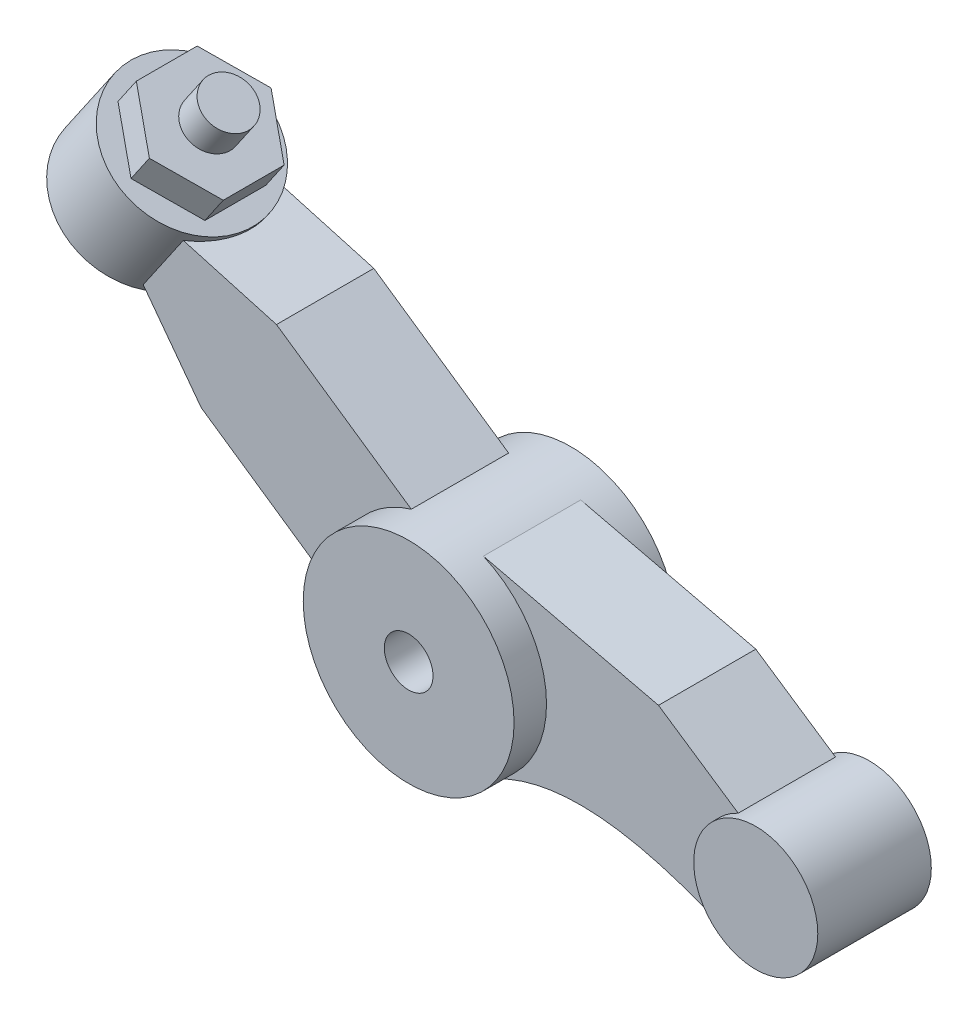
ISO-10303-21;
HEADER;
FILE_DESCRIPTION(('STEP AP214'),'2;1');
FILE_NAME('part.step','',(''),(''),'','','');
FILE_SCHEMA(('AUTOMOTIVE_DESIGN { 1 0 10303 214 1 1 1 1 }'));
ENDSEC;
DATA;
#1=APPLICATION_CONTEXT('core data for automotive mechanical design processes');
#2=APPLICATION_PROTOCOL_DEFINITION('international standard','automotive_design',2000,#1);
#3=PRODUCT_CONTEXT('',#1,'mechanical');
#4=PRODUCT('Part','Part','',(#3));
#5=PRODUCT_RELATED_PRODUCT_CATEGORY('part','',(#4));
#6=PRODUCT_DEFINITION_FORMATION('','',#4);
#7=PRODUCT_DEFINITION_CONTEXT('part definition',#1,'design');
#8=PRODUCT_DEFINITION('design','',#6,#7);
#9=PRODUCT_DEFINITION_SHAPE('','',#8);
#10=(LENGTH_UNIT() NAMED_UNIT(*) SI_UNIT(.MILLI.,.METRE.));
#11=(NAMED_UNIT(*) PLANE_ANGLE_UNIT() SI_UNIT($,.RADIAN.));
#12=(NAMED_UNIT(*) SI_UNIT($,.STERADIAN.) SOLID_ANGLE_UNIT());
#13=UNCERTAINTY_MEASURE_WITH_UNIT(LENGTH_MEASURE(1.E-05),#10,'distance_accuracy_value','');
#14=(GEOMETRIC_REPRESENTATION_CONTEXT(3) GLOBAL_UNCERTAINTY_ASSIGNED_CONTEXT((#13)) GLOBAL_UNIT_ASSIGNED_CONTEXT((#10,
#11,#12)) REPRESENTATION_CONTEXT('',''));
#15=CARTESIAN_POINT('',(0.,0.,0.));
#16=DIRECTION('',(0.,0.,1.));
#17=DIRECTION('',(1.,0.,0.));
#18=AXIS2_PLACEMENT_3D('',#15,#16,#17);
#19=CARTESIAN_POINT('',(0.,0.,1.));
#20=DIRECTION('',(0.,0.,-1.));
#21=DIRECTION('',(-1.,0.,0.));
#22=AXIS2_PLACEMENT_3D('',#19,#20,#21);
#23=CYLINDRICAL_SURFACE('',#22,0.3);
#24=CARTESIAN_POINT('',(0.,0.,1.));
#25=DIRECTION('',(0.,0.,1.));
#26=DIRECTION('',(1.,0.,0.));
#27=AXIS2_PLACEMENT_3D('',#24,#25,#26);
#28=CIRCLE('',#27,0.3);
#29=CARTESIAN_POINT('',(0.3,0.,1.));
#30=VERTEX_POINT('',#29);
#31=EDGE_CURVE('E286',#30,#30,#28,.T.);
#32=ORIENTED_EDGE('',*,*,#31,.T.);
#33=EDGE_LOOP('',(#32));
#34=FACE_BOUND('',#33,.T.);
#35=CARTESIAN_POINT('',(0.,0.,-1.));
#36=DIRECTION('',(0.,0.,1.));
#37=DIRECTION('',(1.,0.,0.));
#38=AXIS2_PLACEMENT_3D('',#35,#36,#37);
#39=CIRCLE('',#38,0.3);
#40=CARTESIAN_POINT('',(0.3,0.,-1.));
#41=VERTEX_POINT('',#40);
#42=EDGE_CURVE('E287',#41,#41,#39,.T.);
#43=ORIENTED_EDGE('',*,*,#42,.F.);
#44=EDGE_LOOP('',(#43));
#45=FACE_BOUND('',#44,.T.);
#46=ADVANCED_FACE('F35',(#34,#45),#23,.F.);
#47=CARTESIAN_POINT('',(0.,0.,1.));
#48=DIRECTION('',(0.,0.,-1.));
#49=DIRECTION('',(-1.,0.,0.));
#50=AXIS2_PLACEMENT_3D('',#47,#48,#49);
#51=CYLINDRICAL_SURFACE('',#50,1.3);
#52=DIRECTION('',(0.,0.,-1.));
#53=VECTOR('',#52,1.);
#54=CARTESIAN_POINT('',(-0.367546709514205,1.2469600700605,0.6));
#55=LINE('',#54,#53);
#56=CARTESIAN_POINT('',(-0.367546709514206,1.2469600700605,0.6));
#57=VERTEX_POINT('',#56);
#58=CARTESIAN_POINT('',(-0.367546709514206,1.2469600700605,-0.6));
#59=VERTEX_POINT('',#58);
#60=EDGE_CURVE('E229',#57,#59,#55,.T.);
#61=ORIENTED_EDGE('',*,*,#60,.F.);
#62=CARTESIAN_POINT('',(0.,0.,0.6));
#63=DIRECTION('',(0.,0.,1.));
#64=DIRECTION('',(1.,0.,0.));
#65=AXIS2_PLACEMENT_3D('',#62,#63,#64);
#66=CIRCLE('',#65,1.3);
#67=CARTESIAN_POINT('',(-1.29574513197099,-0.105093068151436,0.6));
#68=VERTEX_POINT('',#67);
#69=EDGE_CURVE('E197',#57,#68,#66,.T.);
#70=ORIENTED_EDGE('',*,*,#69,.T.);
#71=DIRECTION('',(0.,0.,-1.));
#72=VECTOR('',#71,1.);
#73=CARTESIAN_POINT('',(-1.29574513197099,-0.105093068151436,0.6));
#74=LINE('',#73,#72);
#75=CARTESIAN_POINT('',(-1.29574513197099,-0.105093068151436,-0.6));
#76=VERTEX_POINT('',#75);
#77=EDGE_CURVE('E210',#68,#76,#74,.T.);
#78=ORIENTED_EDGE('',*,*,#77,.T.);
#79=CARTESIAN_POINT('',(0.,0.,-0.6));
#80=DIRECTION('',(0.,0.,1.));
#81=DIRECTION('',(1.,0.,0.));
#82=AXIS2_PLACEMENT_3D('',#79,#80,#81);
#83=CIRCLE('',#82,1.3);
#84=EDGE_CURVE('E196',#59,#76,#83,.T.);
#85=ORIENTED_EDGE('',*,*,#84,.F.);
#86=EDGE_LOOP('',(#61,#70,#78,#85));
#87=FACE_BOUND('',#86,.T.);
#88=DIRECTION('',(0.,0.,-1.));
#89=VECTOR('',#88,1.);
#90=CARTESIAN_POINT('',(0.676601676553519,-1.11004962559562,0.6));
#91=LINE('',#90,#89);
#92=CARTESIAN_POINT('',(0.676601676553519,-1.11004962559562,0.6));
#93=VERTEX_POINT('',#92);
#94=CARTESIAN_POINT('',(0.676601676553519,-1.11004962559562,-0.6));
#95=VERTEX_POINT('',#94);
#96=EDGE_CURVE('E277',#93,#95,#91,.T.);
#97=ORIENTED_EDGE('',*,*,#96,.F.);
#98=CARTESIAN_POINT('',(0.,0.,0.6));
#99=DIRECTION('',(0.,0.,1.));
#100=DIRECTION('',(1.,0.,0.));
#101=AXIS2_PLACEMENT_3D('',#98,#99,#100);
#102=CIRCLE('',#101,1.3);
#103=CARTESIAN_POINT('',(0.521604487071266,1.19076813824822,0.6));
#104=VERTEX_POINT('',#103);
#105=EDGE_CURVE('E311',#93,#104,#102,.T.);
#106=ORIENTED_EDGE('',*,*,#105,.T.);
#107=DIRECTION('',(0.,0.,-1.));
#108=VECTOR('',#107,1.);
#109=CARTESIAN_POINT('',(0.521604487071265,1.19076813824822,0.6));
#110=LINE('',#109,#108);
#111=CARTESIAN_POINT('',(0.521604487071265,1.19076813824822,-0.6));
#112=VERTEX_POINT('',#111);
#113=EDGE_CURVE('E308',#104,#112,#110,.T.);
#114=ORIENTED_EDGE('',*,*,#113,.T.);
#115=CARTESIAN_POINT('',(0.,0.,-0.6));
#116=DIRECTION('',(0.,0.,1.));
#117=DIRECTION('',(1.,0.,0.));
#118=AXIS2_PLACEMENT_3D('',#115,#116,#117);
#119=CIRCLE('',#118,1.3);
#120=EDGE_CURVE('E246',#95,#112,#119,.T.);
#121=ORIENTED_EDGE('',*,*,#120,.F.);
#122=EDGE_LOOP('',(#97,#106,#114,#121));
#123=FACE_BOUND('',#122,.T.);
#124=CARTESIAN_POINT('',(0.,0.,1.));
#125=DIRECTION('',(0.,0.,1.));
#126=DIRECTION('',(1.,0.,0.));
#127=AXIS2_PLACEMENT_3D('',#124,#125,#126);
#128=CIRCLE('',#127,1.3);
#129=CARTESIAN_POINT('',(1.3,0.,1.));
#130=VERTEX_POINT('',#129);
#131=EDGE_CURVE('E281',#130,#130,#128,.T.);
#132=ORIENTED_EDGE('',*,*,#131,.F.);
#133=EDGE_LOOP('',(#132));
#134=FACE_BOUND('',#133,.T.);
#135=CARTESIAN_POINT('',(0.,0.,-1.));
#136=DIRECTION('',(0.,0.,1.));
#137=DIRECTION('',(1.,0.,0.));
#138=AXIS2_PLACEMENT_3D('',#135,#136,#137);
#139=CIRCLE('',#138,1.3);
#140=CARTESIAN_POINT('',(1.3,0.,-1.));
#141=VERTEX_POINT('',#140);
#142=EDGE_CURVE('E284',#141,#141,#139,.T.);
#143=ORIENTED_EDGE('',*,*,#142,.T.);
#144=EDGE_LOOP('',(#143));
#145=FACE_BOUND('',#144,.T.);
#146=ADVANCED_FACE('F263',(#87,#123,#134,#145),#51,.T.);
#147=CARTESIAN_POINT('',(0.,0.,1.));
#148=DIRECTION('',(0.,0.,1.));
#149=DIRECTION('',(1.,0.,0.));
#150=AXIS2_PLACEMENT_3D('',#147,#148,#149);
#151=PLANE('',#150);
#152=ORIENTED_EDGE('',*,*,#31,.F.);
#153=EDGE_LOOP('',(#152));
#154=FACE_BOUND('',#153,.T.);
#155=ORIENTED_EDGE('',*,*,#131,.T.);
#156=EDGE_LOOP('',(#155));
#157=FACE_BOUND('',#156,.T.);
#158=ADVANCED_FACE('F260',(#154,#157),#151,.T.);
#159=CARTESIAN_POINT('',(0.,0.,-1.));
#160=DIRECTION('',(0.,0.,1.));
#161=DIRECTION('',(1.,0.,0.));
#162=AXIS2_PLACEMENT_3D('',#159,#160,#161);
#163=PLANE('',#162);
#164=ORIENTED_EDGE('',*,*,#42,.T.);
#165=EDGE_LOOP('',(#164));
#166=FACE_BOUND('',#165,.T.);
#167=ORIENTED_EDGE('',*,*,#142,.F.);
#168=EDGE_LOOP('',(#167));
#169=FACE_BOUND('',#168,.T.);
#170=ADVANCED_FACE('F257',(#166,#169),#163,.F.);
#171=CARTESIAN_POINT('',(3.66351130448171,-1.376462422252,0.6));
#172=CARTESIAN_POINT('',(2.75633744734306,-0.967349054136237,0.6));
#173=CARTESIAN_POINT('',(1.62181799975988,-0.614489973839438,0.6));
#174=CARTESIAN_POINT('',(0.676601676553519,-1.11004962559562,0.6));
#175=B_SPLINE_CURVE_WITH_KNOTS('',3,(#171,#172,#173,#174),.UNSPECIFIED.,.F.,.F.,(4,4),(0.,1.),.UNSPECIFIED.);
#176=DIRECTION('',(0.,0.,-1.));
#177=VECTOR('',#176,1.);
#178=SURFACE_OF_LINEAR_EXTRUSION('',#175,#177);
#179=CARTESIAN_POINT('',(3.66351130448171,-1.376462422252,-0.6));
#180=CARTESIAN_POINT('',(2.75633744734306,-0.967349054136237,-0.6));
#181=CARTESIAN_POINT('',(1.62181799975988,-0.614489973839438,-0.6));
#182=CARTESIAN_POINT('',(0.676601676553519,-1.11004962559562,-0.6));
#183=B_SPLINE_CURVE_WITH_KNOTS('',3,(#179,#180,#181,#182),.UNSPECIFIED.,.F.,.F.,(4,4),(0.,1.),.UNSPECIFIED.);
#184=CARTESIAN_POINT('',(3.66351130448171,-1.376462422252,-0.6));
#185=VERTEX_POINT('',#184);
#186=EDGE_CURVE('E236',#185,#95,#183,.T.);
#187=ORIENTED_EDGE('',*,*,#186,.F.);
#188=DIRECTION('',(0.,0.,-1.));
#189=VECTOR('',#188,1.);
#190=CARTESIAN_POINT('',(3.66351130448171,-1.376462422252,0.6));
#191=LINE('',#190,#189);
#192=CARTESIAN_POINT('',(3.66351130448171,-1.376462422252,0.6));
#193=VERTEX_POINT('',#192);
#194=EDGE_CURVE('E292',#193,#185,#191,.T.);
#195=ORIENTED_EDGE('',*,*,#194,.F.);
#196=EDGE_CURVE('E239',#193,#93,#175,.T.);
#197=ORIENTED_EDGE('',*,*,#196,.T.);
#198=ORIENTED_EDGE('',*,*,#96,.T.);
#199=EDGE_LOOP('',(#187,#195,#197,#198));
#200=FACE_BOUND('',#199,.T.);
#201=ADVANCED_FACE('F252',(#200),#178,.T.);
#202=CARTESIAN_POINT('',(1.14784729029702,1.70754456504759,0.6));
#203=DIRECTION('',(-0.557887392801173,-0.829916656630959,0.));
#204=DIRECTION('',(0.829916656630959,-0.557887392801173,0.));
#205=AXIS2_PLACEMENT_3D('',#202,#203,#204);
#206=PLANE('',#205);
#207=DIRECTION('',(-0.829916656630959,0.557887392801173,0.));
#208=VECTOR('',#207,1.);
#209=CARTESIAN_POINT('',(1.14784729029702,1.70754456504759,-0.6));
#210=LINE('',#209,#208);
#211=CARTESIAN_POINT('',(3.66351130448171,0.016462422252005,-0.6));
#212=VERTEX_POINT('',#211);
#213=CARTESIAN_POINT('',(2.68078674033149,0.677070497237568,-0.6));
#214=VERTEX_POINT('',#213);
#215=EDGE_CURVE('E317',#212,#214,#210,.T.);
#216=ORIENTED_EDGE('',*,*,#215,.T.);
#217=DIRECTION('',(0.,0.,-1.));
#218=VECTOR('',#217,1.);
#219=CARTESIAN_POINT('',(2.68078674033149,0.677070497237568,0.6));
#220=LINE('',#219,#218);
#221=CARTESIAN_POINT('',(2.68078674033149,0.677070497237568,0.6));
#222=VERTEX_POINT('',#221);
#223=EDGE_CURVE('E305',#222,#214,#220,.T.);
#224=ORIENTED_EDGE('',*,*,#223,.F.);
#225=DIRECTION('',(-0.829916656630959,0.557887392801173,0.));
#226=VECTOR('',#225,1.);
#227=CARTESIAN_POINT('',(1.14784729029702,1.70754456504759,0.6));
#228=LINE('',#227,#226);
#229=CARTESIAN_POINT('',(3.66351130448171,0.0164624222520048,0.6));
#230=VERTEX_POINT('',#229);
#231=EDGE_CURVE('E332',#230,#222,#228,.T.);
#232=ORIENTED_EDGE('',*,*,#231,.F.);
#233=DIRECTION('',(0.,0.,-1.));
#234=VECTOR('',#233,1.);
#235=CARTESIAN_POINT('',(3.66351130448171,0.0164624222520045,0.6));
#236=LINE('',#235,#234);
#237=EDGE_CURVE('E302',#230,#212,#236,.T.);
#238=ORIENTED_EDGE('',*,*,#237,.T.);
#239=EDGE_LOOP('',(#216,#224,#232,#238));
#240=FACE_BOUND('',#239,.T.);
#241=ADVANCED_FACE('F256',(#240),#206,.F.);
#242=CARTESIAN_POINT('',(0.296065386840388,1.24442683406666,0.6));
#243=DIRECTION('',(-0.231452793916526,-0.972846135927071,0.));
#244=DIRECTION('',(0.972846135927072,-0.231452793916526,0.));
#245=AXIS2_PLACEMENT_3D('',#242,#243,#244);
#246=PLANE('',#245);
#247=DIRECTION('',(-0.972846135927071,0.231452793916526,0.));
#248=VECTOR('',#247,1.);
#249=CARTESIAN_POINT('',(0.296065386840388,1.24442683406666,-0.6));
#250=LINE('',#249,#248);
#251=EDGE_CURVE('E314',#214,#112,#250,.T.);
#252=ORIENTED_EDGE('',*,*,#251,.T.);
#253=ORIENTED_EDGE('',*,*,#113,.F.);
#254=DIRECTION('',(-0.972846135927071,0.231452793916526,0.));
#255=VECTOR('',#254,1.);
#256=CARTESIAN_POINT('',(0.296065386840388,1.24442683406666,0.6));
#257=LINE('',#256,#255);
#258=EDGE_CURVE('E330',#222,#104,#257,.T.);
#259=ORIENTED_EDGE('',*,*,#258,.F.);
#260=ORIENTED_EDGE('',*,*,#223,.T.);
#261=EDGE_LOOP('',(#252,#253,#259,#260));
#262=FACE_BOUND('',#261,.T.);
#263=ADVANCED_FACE('F349',(#262),#246,.F.);
#264=CARTESIAN_POINT('',(0.,0.,0.6));
#265=DIRECTION('',(0.,0.,1.));
#266=DIRECTION('',(1.,0.,0.));
#267=AXIS2_PLACEMENT_3D('',#264,#265,#266);
#268=PLANE('',#267);
#269=ORIENTED_EDGE('',*,*,#196,.F.);
#270=CARTESIAN_POINT('',(3.98,-0.68,0.6));
#271=DIRECTION('',(0.,0.,1.));
#272=DIRECTION('',(1.,0.,0.));
#273=AXIS2_PLACEMENT_3D('',#270,#271,#272);
#274=CIRCLE('',#273,0.765);
#275=EDGE_CURVE('E245',#230,#193,#274,.T.);
#276=ORIENTED_EDGE('',*,*,#275,.F.);
#277=ORIENTED_EDGE('',*,*,#231,.T.);
#278=ORIENTED_EDGE('',*,*,#258,.T.);
#279=ORIENTED_EDGE('',*,*,#105,.F.);
#280=EDGE_LOOP('',(#269,#276,#277,#278,#279));
#281=FACE_BOUND('',#280,.T.);
#282=ADVANCED_FACE('F344',(#281),#268,.T.);
#283=CARTESIAN_POINT('',(0.,0.,-0.6));
#284=DIRECTION('',(0.,0.,1.));
#285=DIRECTION('',(1.,0.,0.));
#286=AXIS2_PLACEMENT_3D('',#283,#284,#285);
#287=PLANE('',#286);
#288=ORIENTED_EDGE('',*,*,#186,.T.);
#289=ORIENTED_EDGE('',*,*,#120,.T.);
#290=ORIENTED_EDGE('',*,*,#251,.F.);
#291=ORIENTED_EDGE('',*,*,#215,.F.);
#292=CARTESIAN_POINT('',(3.98,-0.68,-0.6));
#293=DIRECTION('',(0.,0.,1.));
#294=DIRECTION('',(1.,0.,0.));
#295=AXIS2_PLACEMENT_3D('',#292,#293,#294);
#296=CIRCLE('',#295,0.765);
#297=EDGE_CURVE('E319',#212,#185,#296,.T.);
#298=ORIENTED_EDGE('',*,*,#297,.T.);
#299=EDGE_LOOP('',(#288,#289,#290,#291,#298));
#300=FACE_BOUND('',#299,.T.);
#301=ADVANCED_FACE('F352',(#300),#287,.F.);
#302=CARTESIAN_POINT('',(3.98,-0.68,0.7));
#303=DIRECTION('',(0.,0.,-1.));
#304=DIRECTION('',(-1.,0.,0.));
#305=AXIS2_PLACEMENT_3D('',#302,#303,#304);
#306=CYLINDRICAL_SURFACE('',#305,0.765);
#307=ORIENTED_EDGE('',*,*,#275,.T.);
#308=ORIENTED_EDGE('',*,*,#194,.T.);
#309=ORIENTED_EDGE('',*,*,#297,.F.);
#310=ORIENTED_EDGE('',*,*,#237,.F.);
#311=EDGE_LOOP('',(#307,#308,#309,#310));
#312=FACE_BOUND('',#311,.T.);
#313=CARTESIAN_POINT('',(3.98,-0.68,0.7));
#314=DIRECTION('',(0.,0.,1.));
#315=DIRECTION('',(1.,0.,0.));
#316=AXIS2_PLACEMENT_3D('',#313,#314,#315);
#317=CIRCLE('',#316,0.765);
#318=CARTESIAN_POINT('',(4.745,-0.68,0.7));
#319=VERTEX_POINT('',#318);
#320=EDGE_CURVE('E233',#319,#319,#317,.T.);
#321=ORIENTED_EDGE('',*,*,#320,.F.);
#322=EDGE_LOOP('',(#321));
#323=FACE_BOUND('',#322,.T.);
#324=CARTESIAN_POINT('',(3.98,-0.68,-0.7));
#325=DIRECTION('',(0.,0.,1.));
#326=DIRECTION('',(1.,0.,0.));
#327=AXIS2_PLACEMENT_3D('',#324,#325,#326);
#328=CIRCLE('',#327,0.765);
#329=CARTESIAN_POINT('',(4.745,-0.68,-0.7));
#330=VERTEX_POINT('',#329);
#331=EDGE_CURVE('E232',#330,#330,#328,.T.);
#332=ORIENTED_EDGE('',*,*,#331,.T.);
#333=EDGE_LOOP('',(#332));
#334=FACE_BOUND('',#333,.T.);
#335=ADVANCED_FACE('F339',(#312,#323,#334),#306,.T.);
#336=CARTESIAN_POINT('',(0.,0.,0.7));
#337=DIRECTION('',(0.,0.,1.));
#338=DIRECTION('',(1.,0.,0.));
#339=AXIS2_PLACEMENT_3D('',#336,#337,#338);
#340=PLANE('',#339);
#341=ORIENTED_EDGE('',*,*,#320,.T.);
#342=EDGE_LOOP('',(#341));
#343=FACE_BOUND('',#342,.T.);
#344=ADVANCED_FACE('F367',(#343),#340,.T.);
#345=CARTESIAN_POINT('',(0.,0.,-0.7));
#346=DIRECTION('',(0.,0.,1.));
#347=DIRECTION('',(1.,0.,0.));
#348=AXIS2_PLACEMENT_3D('',#345,#346,#347);
#349=PLANE('',#348);
#350=ORIENTED_EDGE('',*,*,#331,.F.);
#351=EDGE_LOOP('',(#350));
#352=FACE_BOUND('',#351,.T.);
#353=ADVANCED_FACE('F368',(#352),#349,.F.);
#354=CARTESIAN_POINT('',(0.464099211228392,0.676026569105966,0.6));
#355=DIRECTION('',(0.565974647839503,0.824422645251179,0.));
#356=DIRECTION('',(-0.824422645251179,0.565974647839503,0.));
#357=AXIS2_PLACEMENT_3D('',#354,#355,#356);
#358=PLANE('',#357);
#359=DIRECTION('',(0.824422645251179,-0.565974647839503,0.));
#360=VECTOR('',#359,1.);
#361=CARTESIAN_POINT('',(0.464099211228392,0.676026569105966,-0.6));
#362=LINE('',#361,#360);
#363=CARTESIAN_POINT('',(-2.02976185940636,2.38808791208753,-0.6));
#364=VERTEX_POINT('',#363);
#365=EDGE_CURVE('E213',#364,#59,#362,.T.);
#366=ORIENTED_EDGE('',*,*,#365,.F.);
#367=DIRECTION('',(0.,0.,-1.));
#368=VECTOR('',#367,1.);
#369=CARTESIAN_POINT('',(-2.02976185940636,2.38808791208753,0.6));
#370=LINE('',#369,#368);
#371=CARTESIAN_POINT('',(-2.02976185940636,2.38808791208753,0.6));
#372=VERTEX_POINT('',#371);
#373=EDGE_CURVE('E226',#372,#364,#370,.T.);
#374=ORIENTED_EDGE('',*,*,#373,.F.);
#375=DIRECTION('',(0.824422645251179,-0.565974647839503,0.));
#376=VECTOR('',#375,1.);
#377=CARTESIAN_POINT('',(0.464099211228392,0.676026569105966,0.6));
#378=LINE('',#377,#376);
#379=EDGE_CURVE('E199',#372,#57,#378,.T.);
#380=ORIENTED_EDGE('',*,*,#379,.T.);
#381=ORIENTED_EDGE('',*,*,#60,.T.);
#382=EDGE_LOOP('',(#366,#374,#380,#381));
#383=FACE_BOUND('',#382,.T.);
#384=ADVANCED_FACE('F371',(#383),#358,.T.);
#385=CARTESIAN_POINT('',(0.474029535358526,1.68278713755075,0.6));
#386=DIRECTION('',(0.271140796808346,0.962539697002744,0.));
#387=DIRECTION('',(-0.962539697002745,0.271140796808346,0.));
#388=AXIS2_PLACEMENT_3D('',#385,#386,#387);
#389=PLANE('',#388);
#390=CARTESIAN_POINT('',(-3.87456963522722,2.90775754426154,0.));
#391=DIRECTION('',(0.271140796808346,0.962539697002744,0.));
#392=DIRECTION('',(0.962539697002745,-0.271140796808346,0.));
#393=AXIS2_PLACEMENT_3D('',#390,#391,#392);
#394=ELLIPSE('',#393,0.960930934530566,0.91);
#395=CARTESIAN_POINT('',(-3.17916312445784,2.71186632437434,0.6));
#396=VERTEX_POINT('',#395);
#397=CARTESIAN_POINT('',(-3.17916312445784,2.71186632437434,-0.6));
#398=VERTEX_POINT('',#397);
#399=EDGE_CURVE('E192',#396,#398,#394,.T.);
#400=ORIENTED_EDGE('',*,*,#399,.F.);
#401=DIRECTION('',(0.962539697002745,-0.271140796808346,0.));
#402=VECTOR('',#401,1.);
#403=CARTESIAN_POINT('',(0.474029535358526,1.68278713755075,0.6));
#404=LINE('',#403,#402);
#405=EDGE_CURVE('E203',#396,#372,#404,.T.);
#406=ORIENTED_EDGE('',*,*,#405,.T.);
#407=ORIENTED_EDGE('',*,*,#373,.T.);
#408=DIRECTION('',(0.962539697002745,-0.271140796808346,0.));
#409=VECTOR('',#408,1.);
#410=CARTESIAN_POINT('',(0.474029535358526,1.68278713755075,-0.6));
#411=LINE('',#410,#409);
#412=EDGE_CURVE('E216',#398,#364,#411,.T.);
#413=ORIENTED_EDGE('',*,*,#412,.F.);
#414=EDGE_LOOP('',(#400,#406,#407,#413));
#415=FACE_BOUND('',#414,.T.);
#416=ADVANCED_FACE('F378',(#415),#389,.T.);
#417=CARTESIAN_POINT('',(-1.40004442139719,-1.04706836873868,0.6));
#418=DIRECTION('',(0.800813307334535,0.598914056268446,0.));
#419=DIRECTION('',(-0.598914056268446,0.800813307334535,0.));
#420=AXIS2_PLACEMENT_3D('',#417,#418,#419);
#421=PLANE('',#420);
#422=DIRECTION('',(0.598914056268446,-0.800813307334535,0.));
#423=VECTOR('',#422,1.);
#424=CARTESIAN_POINT('',(-1.40004442139719,-1.04706836873868,0.6));
#425=LINE('',#424,#423);
#426=CARTESIAN_POINT('',(-3.67314384891565,1.99231307739553,0.6));
#427=VERTEX_POINT('',#426);
#428=CARTESIAN_POINT('',(-2.95796028186314,1.0360347738756,0.6));
#429=VERTEX_POINT('',#428);
#430=EDGE_CURVE('E205',#427,#429,#425,.T.);
#431=ORIENTED_EDGE('',*,*,#430,.F.);
#432=CARTESIAN_POINT('',(-4.10584157080419,2.57087704682484,0.));
#433=DIRECTION('',(0.800813307334535,0.598914056268446,0.));
#434=DIRECTION('',(-0.598914056268446,0.800813307334535,0.));
#435=AXIS2_PLACEMENT_3D('',#432,#433,#434);
#436=ELLIPSE('',#435,0.960930934530567,0.91);
#437=CARTESIAN_POINT('',(-3.67314384891565,1.99231307739553,-0.6));
#438=VERTEX_POINT('',#437);
#439=EDGE_CURVE('E189',#427,#438,#436,.T.);
#440=ORIENTED_EDGE('',*,*,#439,.T.);
#441=DIRECTION('',(0.598914056268446,-0.800813307334535,0.));
#442=VECTOR('',#441,1.);
#443=CARTESIAN_POINT('',(-1.40004442139719,-1.04706836873868,-0.6));
#444=LINE('',#443,#442);
#445=CARTESIAN_POINT('',(-2.95796028186314,1.0360347738756,-0.6));
#446=VERTEX_POINT('',#445);
#447=EDGE_CURVE('E218',#438,#446,#444,.T.);
#448=ORIENTED_EDGE('',*,*,#447,.T.);
#449=DIRECTION('',(0.,0.,-1.));
#450=VECTOR('',#449,1.);
#451=CARTESIAN_POINT('',(-2.95796028186314,1.0360347738756,0.6));
#452=LINE('',#451,#450);
#453=EDGE_CURVE('E223',#429,#446,#452,.T.);
#454=ORIENTED_EDGE('',*,*,#453,.F.);
#455=EDGE_LOOP('',(#431,#440,#448,#454));
#456=FACE_BOUND('',#455,.T.);
#457=ADVANCED_FACE('F382',(#456),#421,.F.);
#458=CARTESIAN_POINT('',(-0.464099211228392,-0.676026569105967,0.6));
#459=DIRECTION('',(0.565974647839502,0.824422645251179,0.));
#460=DIRECTION('',(-0.824422645251179,0.565974647839502,0.));
#461=AXIS2_PLACEMENT_3D('',#458,#459,#460);
#462=PLANE('',#461);
#463=DIRECTION('',(0.824422645251179,-0.565974647839502,0.));
#464=VECTOR('',#463,1.);
#465=CARTESIAN_POINT('',(-0.464099211228392,-0.676026569105967,-0.6));
#466=LINE('',#465,#464);
#467=EDGE_CURVE('E200',#446,#76,#466,.T.);
#468=ORIENTED_EDGE('',*,*,#467,.T.);
#469=ORIENTED_EDGE('',*,*,#77,.F.);
#470=DIRECTION('',(0.824422645251179,-0.565974647839502,0.));
#471=VECTOR('',#470,1.);
#472=CARTESIAN_POINT('',(-0.464099211228392,-0.676026569105967,0.6));
#473=LINE('',#472,#471);
#474=EDGE_CURVE('E207',#429,#68,#473,.T.);
#475=ORIENTED_EDGE('',*,*,#474,.F.);
#476=ORIENTED_EDGE('',*,*,#453,.T.);
#477=EDGE_LOOP('',(#468,#469,#475,#476));
#478=FACE_BOUND('',#477,.T.);
#479=ADVANCED_FACE('F386',(#478),#462,.F.);
#480=CARTESIAN_POINT('',(0.,0.,0.6));
#481=DIRECTION('',(0.,0.,1.));
#482=DIRECTION('',(1.,0.,0.));
#483=AXIS2_PLACEMENT_3D('',#480,#481,#482);
#484=PLANE('',#483);
#485=DIRECTION('',(0.565974647839501,0.82442264525118,0.));
#486=VECTOR('',#485,1.);
#487=CARTESIAN_POINT('',(-3.10920768389662,2.8137663822256,0.6));
#488=LINE('',#487,#486);
#489=EDGE_CURVE('E194',#427,#396,#488,.T.);
#490=ORIENTED_EDGE('',*,*,#489,.F.);
#491=ORIENTED_EDGE('',*,*,#430,.T.);
#492=ORIENTED_EDGE('',*,*,#474,.T.);
#493=ORIENTED_EDGE('',*,*,#69,.F.);
#494=ORIENTED_EDGE('',*,*,#379,.F.);
#495=ORIENTED_EDGE('',*,*,#405,.F.);
#496=EDGE_LOOP('',(#490,#491,#492,#493,#494,#495));
#497=FACE_BOUND('',#496,.T.);
#498=ADVANCED_FACE('F390',(#497),#484,.T.);
#499=CARTESIAN_POINT('',(0.,0.,-0.6));
#500=DIRECTION('',(0.,0.,1.));
#501=DIRECTION('',(1.,0.,0.));
#502=AXIS2_PLACEMENT_3D('',#499,#500,#501);
#503=PLANE('',#502);
#504=ORIENTED_EDGE('',*,*,#447,.F.);
#505=DIRECTION('',(0.565974647839501,0.82442264525118,0.));
#506=VECTOR('',#505,1.);
#507=CARTESIAN_POINT('',(-3.10920768389662,2.8137663822256,-0.6));
#508=LINE('',#507,#506);
#509=EDGE_CURVE('E43',#438,#398,#508,.T.);
#510=ORIENTED_EDGE('',*,*,#509,.T.);
#511=ORIENTED_EDGE('',*,*,#412,.T.);
#512=ORIENTED_EDGE('',*,*,#365,.T.);
#513=ORIENTED_EDGE('',*,*,#84,.T.);
#514=ORIENTED_EDGE('',*,*,#467,.F.);
#515=EDGE_LOOP('',(#504,#510,#511,#512,#513,#514));
#516=FACE_BOUND('',#515,.T.);
#517=ADVANCED_FACE('F392',(#516),#503,.F.);
#518=CARTESIAN_POINT('',(-4.42348440740416,3.7160309064178,0.));
#519=DIRECTION('',(0.565974647839501,0.82442264525118,0.));
#520=DIRECTION('',(-0.82442264525118,0.565974647839501,0.));
#521=AXIS2_PLACEMENT_3D('',#518,#519,#520);
#522=PLANE('',#521);
#523=DIRECTION('',(-0.713970954242688,0.490148422926959,-0.5));
#524=VECTOR('',#523,1.);
#525=CARTESIAN_POINT('',(-3.13738508081232,2.83311045578818,-0.375277674973257));
#526=LINE('',#525,#524);
#527=CARTESIAN_POINT('',(-3.13738508081232,2.83311045578818,-0.375277674973257));
#528=VERTEX_POINT('',#527);
#529=CARTESIAN_POINT('',(-3.67325980022559,3.20099397688385,-0.750555349946513));
#530=VERTEX_POINT('',#529);
#531=EDGE_CURVE('E51',#528,#530,#526,.T.);
#532=ORIENTED_EDGE('',*,*,#531,.F.);
#533=DIRECTION('',(0.,0.,-1.));
#534=VECTOR('',#533,1.);
#535=CARTESIAN_POINT('',(-3.13738508081232,2.83311045578818,0.375277674973256));
#536=LINE('',#535,#534);
#537=CARTESIAN_POINT('',(-3.13738508081232,2.83311045578818,0.375277674973256));
#538=VERTEX_POINT('',#537);
#539=EDGE_CURVE('E55',#538,#528,#536,.T.);
#540=ORIENTED_EDGE('',*,*,#539,.F.);
#541=DIRECTION('',(0.713970954242688,-0.49014842292696,-0.5));
#542=VECTOR('',#541,1.);
#543=CARTESIAN_POINT('',(-3.67325980022558,3.20099397688385,0.750555349946512));
#544=LINE('',#543,#542);
#545=CARTESIAN_POINT('',(-3.67325980022558,3.20099397688385,0.750555349946512));
#546=VERTEX_POINT('',#545);
#547=EDGE_CURVE('E470',#546,#538,#544,.T.);
#548=ORIENTED_EDGE('',*,*,#547,.F.);
#549=DIRECTION('',(0.713970954242688,-0.49014842292696,0.5));
#550=VECTOR('',#549,1.);
#551=CARTESIAN_POINT('',(-4.20913451963885,3.56887749797953,0.375277674973255));
#552=LINE('',#551,#550);
#553=CARTESIAN_POINT('',(-4.20913451963885,3.56887749797953,0.375277674973255));
#554=VERTEX_POINT('',#553);
#555=EDGE_CURVE('E467',#554,#546,#552,.T.);
#556=ORIENTED_EDGE('',*,*,#555,.F.);
#557=DIRECTION('',(0.,0.,1.));
#558=VECTOR('',#557,1.);
#559=CARTESIAN_POINT('',(-4.20913451963885,3.56887749797953,-0.375277674973257));
#560=LINE('',#559,#558);
#561=CARTESIAN_POINT('',(-4.20913451963885,3.56887749797953,-0.375277674973257));
#562=VERTEX_POINT('',#561);
#563=EDGE_CURVE('E464',#562,#554,#560,.T.);
#564=ORIENTED_EDGE('',*,*,#563,.F.);
#565=DIRECTION('',(-0.713970954242688,0.49014842292696,0.499999999999999));
#566=VECTOR('',#565,1.);
#567=CARTESIAN_POINT('',(-3.67325980022559,3.20099397688385,-0.750555349946513));
#568=LINE('',#567,#566);
#569=EDGE_CURVE('E453',#530,#562,#568,.T.);
#570=ORIENTED_EDGE('',*,*,#569,.F.);
#571=EDGE_LOOP('',(#532,#540,#548,#556,#564,#570));
#572=FACE_BOUND('',#571,.T.);
#573=CARTESIAN_POINT('',(-3.67325980022559,3.20099397688385,0.));
#574=DIRECTION('',(0.565974647839501,0.82442264525118,0.));
#575=DIRECTION('',(-0.82442264525118,0.565974647839501,0.));
#576=AXIS2_PLACEMENT_3D('',#573,#574,#575);
#577=CIRCLE('',#576,0.91);
#578=CARTESIAN_POINT('',(-4.42348440740416,3.7160309064178,0.));
#579=VERTEX_POINT('',#578);
#580=EDGE_CURVE('E183',#579,#579,#577,.T.);
#581=ORIENTED_EDGE('',*,*,#580,.T.);
#582=EDGE_LOOP('',(#581));
#583=FACE_BOUND('',#582,.T.);
#584=ADVANCED_FACE('F395',(#572,#583),#522,.T.);
#585=CARTESIAN_POINT('',(-4.28451241989225,2.31061752001258,0.));
#586=DIRECTION('',(-0.565974647839501,-0.82442264525118,0.));
#587=DIRECTION('',(0.82442264525118,-0.565974647839501,0.));
#588=AXIS2_PLACEMENT_3D('',#585,#586,#587);
#589=PLANE('',#588);
#590=CARTESIAN_POINT('',(-4.28451241989225,2.31061752001258,0.));
#591=DIRECTION('',(-0.565974647839501,-0.82442264525118,0.));
#592=DIRECTION('',(0.82442264525118,-0.565974647839501,0.));
#593=AXIS2_PLACEMENT_3D('',#590,#591,#592);
#594=CIRCLE('',#593,0.306197993948028);
#595=CARTESIAN_POINT('',(-4.03207585975101,2.13731721821868,0.));
#596=VERTEX_POINT('',#595);
#597=EDGE_CURVE('E38',#596,#596,#594,.F.);
#598=ORIENTED_EDGE('',*,*,#597,.T.);
#599=EDGE_LOOP('',(#598));
#600=FACE_BOUND('',#599,.T.);
#601=CARTESIAN_POINT('',(-4.28451241989225,2.31061752001258,0.));
#602=DIRECTION('',(0.565974647839501,0.82442264525118,0.));
#603=DIRECTION('',(-0.82442264525118,0.565974647839501,0.));
#604=AXIS2_PLACEMENT_3D('',#601,#602,#603);
#605=CIRCLE('',#604,0.91);
#606=CARTESIAN_POINT('',(-5.03473702707082,2.82565444954652,0.));
#607=VERTEX_POINT('',#606);
#608=EDGE_CURVE('E186',#607,#607,#605,.T.);
#609=ORIENTED_EDGE('',*,*,#608,.F.);
#610=EDGE_LOOP('',(#609));
#611=FACE_BOUND('',#610,.T.);
#612=ADVANCED_FACE('F401',(#600,#611),#589,.T.);
#613=CARTESIAN_POINT('',(-3.67325980022558,3.20099397688385,0.));
#614=DIRECTION('',(0.565974647839501,0.82442264525118,0.));
#615=DIRECTION('',(-0.82442264525118,0.565974647839501,0.));
#616=AXIS2_PLACEMENT_3D('',#613,#614,#615);
#617=CYLINDRICAL_SURFACE('',#616,0.91);
#618=ORIENTED_EDGE('',*,*,#439,.F.);
#619=ORIENTED_EDGE('',*,*,#489,.T.);
#620=ORIENTED_EDGE('',*,*,#399,.T.);
#621=ORIENTED_EDGE('',*,*,#509,.F.);
#622=EDGE_LOOP('',(#618,#619,#620,#621));
#623=FACE_BOUND('',#622,.T.);
#624=ORIENTED_EDGE('',*,*,#608,.T.);
#625=EDGE_LOOP('',(#624));
#626=FACE_BOUND('',#625,.T.);
#627=ORIENTED_EDGE('',*,*,#580,.F.);
#628=EDGE_LOOP('',(#627));
#629=FACE_BOUND('',#628,.T.);
#630=ADVANCED_FACE('F404',(#623,#626,#629),#617,.T.);
#631=CARTESIAN_POINT('',(-4.44139551059928,2.08209496493066,0.));
#632=DIRECTION('',(0.565974647839502,0.824422645251179,0.));
#633=DIRECTION('',(-0.824422645251179,0.565974647839502,0.));
#634=AXIS2_PLACEMENT_3D('',#631,#632,#633);
#635=CONICAL_SURFACE('',#634,0.161747583589263,0.480402273941724);
#636=ORIENTED_EDGE('',*,*,#597,.F.);
#637=EDGE_LOOP('',(#636));
#638=FACE_BOUND('',#637,.T.);
#639=CARTESIAN_POINT('',(-4.44139551059928,2.08209496493066,0.));
#640=DIRECTION('',(0.565974647839502,0.824422645251179,0.));
#641=DIRECTION('',(-0.824422645251179,0.565974647839502,0.));
#642=AXIS2_PLACEMENT_3D('',#639,#640,#641);
#643=CIRCLE('',#642,0.161747583589263);
#644=CARTESIAN_POINT('',(-4.57474388132493,2.17363999659148,0.));
#645=VERTEX_POINT('',#644);
#646=EDGE_CURVE('E175',#645,#645,#643,.T.);
#647=ORIENTED_EDGE('',*,*,#646,.T.);
#648=EDGE_LOOP('',(#647));
#649=FACE_BOUND('',#648,.T.);
#650=ADVANCED_FACE('F408',(#638,#649),#635,.T.);
#651=CARTESIAN_POINT('',(-4.6170645223027,1.82620804160284,0.));
#652=DIRECTION('',(0.565974647839502,0.824422645251179,0.));
#653=DIRECTION('',(0.824422645251179,-0.565974647839502,0.));
#654=AXIS2_PLACEMENT_3D('',#651,#652,#653);
#655=SPHERICAL_SURFACE('',#654,0.35);
#656=ORIENTED_EDGE('',*,*,#646,.F.);
#657=EDGE_LOOP('',(#656));
#658=FACE_BOUND('',#657,.T.);
#659=ADVANCED_FACE('F412',(#658),#655,.T.);
#660=CARTESIAN_POINT('',(-2.91099522167652,3.16287951388865,-0.375277674973257));
#661=DIRECTION('',(-0.41221132262559,0.282987323919751,0.866025403784439));
#662=DIRECTION('',(0.902934052856612,0.,0.429779124890835));
#663=AXIS2_PLACEMENT_3D('',#660,#661,#662);
#664=PLANE('',#663);
#665=ORIENTED_EDGE('',*,*,#531,.T.);
#666=DIRECTION('',(-0.565974647839501,-0.82442264525118,0.));
#667=VECTOR('',#666,1.);
#668=CARTESIAN_POINT('',(-3.44686994108978,3.53076303498433,-0.750555349946513));
#669=LINE('',#668,#667);
#670=CARTESIAN_POINT('',(-3.44686994108978,3.53076303498433,-0.750555349946513));
#671=VERTEX_POINT('',#670);
#672=EDGE_CURVE('E158',#671,#530,#669,.T.);
#673=ORIENTED_EDGE('',*,*,#672,.F.);
#674=DIRECTION('',(-0.713970954242688,0.490148422926959,-0.5));
#675=VECTOR('',#674,1.);
#676=CARTESIAN_POINT('',(-2.91099522167652,3.16287951388865,-0.375277674973257));
#677=LINE('',#676,#675);
#678=CARTESIAN_POINT('',(-2.91099522167652,3.16287951388865,-0.375277674973257));
#679=VERTEX_POINT('',#678);
#680=EDGE_CURVE('E164',#679,#671,#677,.T.);
#681=ORIENTED_EDGE('',*,*,#680,.F.);
#682=DIRECTION('',(-0.565974647839501,-0.82442264525118,0.));
#683=VECTOR('',#682,1.);
#684=CARTESIAN_POINT('',(-2.91099522167652,3.16287951388865,-0.375277674973257));
#685=LINE('',#684,#683);
#686=EDGE_CURVE('E461',#679,#528,#685,.T.);
#687=ORIENTED_EDGE('',*,*,#686,.T.);
#688=EDGE_LOOP('',(#665,#673,#681,#687));
#689=FACE_BOUND('',#688,.T.);
#690=ADVANCED_FACE('F174',(#689),#664,.F.);
#691=CARTESIAN_POINT('',(-3.44686994108978,3.53076303498433,-0.750555349946513));
#692=DIRECTION('',(0.412211322625589,-0.28298732391975,0.866025403784439));
#693=DIRECTION('',(0.902934052856613,0.,-0.429779124890835));
#694=AXIS2_PLACEMENT_3D('',#691,#692,#693);
#695=PLANE('',#694);
#696=ORIENTED_EDGE('',*,*,#569,.T.);
#697=DIRECTION('',(-0.565974647839501,-0.82442264525118,0.));
#698=VECTOR('',#697,1.);
#699=CARTESIAN_POINT('',(-3.98274466050305,3.89864655608,-0.375277674973257));
#700=LINE('',#699,#698);
#701=CARTESIAN_POINT('',(-3.98274466050305,3.89864655608,-0.375277674973257));
#702=VERTEX_POINT('',#701);
#703=EDGE_CURVE('E160',#702,#562,#700,.T.);
#704=ORIENTED_EDGE('',*,*,#703,.F.);
#705=DIRECTION('',(-0.713970954242688,0.49014842292696,0.499999999999999));
#706=VECTOR('',#705,1.);
#707=CARTESIAN_POINT('',(-3.44686994108978,3.53076303498433,-0.750555349946513));
#708=LINE('',#707,#706);
#709=EDGE_CURVE('E153',#671,#702,#708,.T.);
#710=ORIENTED_EDGE('',*,*,#709,.F.);
#711=ORIENTED_EDGE('',*,*,#672,.T.);
#712=EDGE_LOOP('',(#696,#704,#710,#711));
#713=FACE_BOUND('',#712,.T.);
#714=ADVANCED_FACE('F156',(#713),#695,.F.);
#715=CARTESIAN_POINT('',(-3.98274466050305,3.89864655608,-0.375277674973257));
#716=DIRECTION('',(0.82442264525118,-0.565974647839501,0.));
#717=DIRECTION('',(0.565974647839501,0.82442264525118,0.));
#718=AXIS2_PLACEMENT_3D('',#715,#716,#717);
#719=PLANE('',#718);
#720=ORIENTED_EDGE('',*,*,#563,.T.);
#721=DIRECTION('',(-0.565974647839501,-0.82442264525118,0.));
#722=VECTOR('',#721,1.);
#723=CARTESIAN_POINT('',(-3.98274466050305,3.89864655608,0.375277674973255));
#724=LINE('',#723,#722);
#725=CARTESIAN_POINT('',(-3.98274466050305,3.89864655608,0.375277674973255));
#726=VERTEX_POINT('',#725);
#727=EDGE_CURVE('E179',#726,#554,#724,.T.);
#728=ORIENTED_EDGE('',*,*,#727,.F.);
#729=DIRECTION('',(0.,0.,1.));
#730=VECTOR('',#729,1.);
#731=CARTESIAN_POINT('',(-3.98274466050305,3.89864655608,-0.375277674973257));
#732=LINE('',#731,#730);
#733=EDGE_CURVE('E163',#702,#726,#732,.T.);
#734=ORIENTED_EDGE('',*,*,#733,.F.);
#735=ORIENTED_EDGE('',*,*,#703,.T.);
#736=EDGE_LOOP('',(#720,#728,#734,#735));
#737=FACE_BOUND('',#736,.T.);
#738=ADVANCED_FACE('F421',(#737),#719,.F.);
#739=CARTESIAN_POINT('',(-3.98274466050305,3.89864655608,0.375277674973255));
#740=DIRECTION('',(0.41221132262559,-0.282987323919751,-0.866025403784439));
#741=DIRECTION('',(-0.902934052856613,0.,-0.429779124890835));
#742=AXIS2_PLACEMENT_3D('',#739,#740,#741);
#743=PLANE('',#742);
#744=ORIENTED_EDGE('',*,*,#555,.T.);
#745=DIRECTION('',(-0.565974647839501,-0.82442264525118,0.));
#746=VECTOR('',#745,1.);
#747=CARTESIAN_POINT('',(-3.44686994108978,3.53076303498433,0.750555349946512));
#748=LINE('',#747,#746);
#749=CARTESIAN_POINT('',(-3.44686994108978,3.53076303498433,0.750555349946512));
#750=VERTEX_POINT('',#749);
#751=EDGE_CURVE('E477',#750,#546,#748,.T.);
#752=ORIENTED_EDGE('',*,*,#751,.F.);
#753=DIRECTION('',(0.713970954242688,-0.49014842292696,0.5));
#754=VECTOR('',#753,1.);
#755=CARTESIAN_POINT('',(-3.98274466050305,3.89864655608,0.375277674973255));
#756=LINE('',#755,#754);
#757=EDGE_CURVE('E457',#726,#750,#756,.T.);
#758=ORIENTED_EDGE('',*,*,#757,.F.);
#759=ORIENTED_EDGE('',*,*,#727,.T.);
#760=EDGE_LOOP('',(#744,#752,#758,#759));
#761=FACE_BOUND('',#760,.T.);
#762=ADVANCED_FACE('F424',(#761),#743,.F.);
#763=CARTESIAN_POINT('',(-3.44686994108978,3.53076303498433,0.750555349946512));
#764=DIRECTION('',(-0.41221132262559,0.282987323919751,-0.866025403784439));
#765=DIRECTION('',(-0.902934052856613,0.,0.429779124890835));
#766=AXIS2_PLACEMENT_3D('',#763,#764,#765);
#767=PLANE('',#766);
#768=ORIENTED_EDGE('',*,*,#547,.T.);
#769=DIRECTION('',(-0.565974647839501,-0.82442264525118,0.));
#770=VECTOR('',#769,1.);
#771=CARTESIAN_POINT('',(-2.91099522167652,3.16287951388865,0.375277674973256));
#772=LINE('',#771,#770);
#773=CARTESIAN_POINT('',(-2.91099522167652,3.16287951388865,0.375277674973256));
#774=VERTEX_POINT('',#773);
#775=EDGE_CURVE('E474',#774,#538,#772,.T.);
#776=ORIENTED_EDGE('',*,*,#775,.F.);
#777=DIRECTION('',(0.713970954242688,-0.49014842292696,-0.5));
#778=VECTOR('',#777,1.);
#779=CARTESIAN_POINT('',(-3.44686994108978,3.53076303498433,0.750555349946512));
#780=LINE('',#779,#778);
#781=EDGE_CURVE('E459',#750,#774,#780,.T.);
#782=ORIENTED_EDGE('',*,*,#781,.F.);
#783=ORIENTED_EDGE('',*,*,#751,.T.);
#784=EDGE_LOOP('',(#768,#776,#782,#783));
#785=FACE_BOUND('',#784,.T.);
#786=ADVANCED_FACE('F428',(#785),#767,.F.);
#787=CARTESIAN_POINT('',(-2.91099522167652,3.16287951388865,0.375277674973256));
#788=DIRECTION('',(-0.82442264525118,0.565974647839501,0.));
#789=DIRECTION('',(-0.565974647839501,-0.82442264525118,0.));
#790=AXIS2_PLACEMENT_3D('',#787,#788,#789);
#791=PLANE('',#790);
#792=ORIENTED_EDGE('',*,*,#539,.T.);
#793=ORIENTED_EDGE('',*,*,#686,.F.);
#794=DIRECTION('',(0.,0.,-1.));
#795=VECTOR('',#794,1.);
#796=CARTESIAN_POINT('',(-2.91099522167652,3.16287951388865,0.375277674973256));
#797=LINE('',#796,#795);
#798=EDGE_CURVE('E169',#774,#679,#797,.T.);
#799=ORIENTED_EDGE('',*,*,#798,.F.);
#800=ORIENTED_EDGE('',*,*,#775,.T.);
#801=EDGE_LOOP('',(#792,#793,#799,#800));
#802=FACE_BOUND('',#801,.T.);
#803=ADVANCED_FACE('F432',(#802),#791,.F.);
#804=CARTESIAN_POINT('',(0.543335661925926,0.79144573944114,0.));
#805=DIRECTION('',(0.565974647839501,0.82442264525118,0.));
#806=DIRECTION('',(-0.82442264525118,0.565974647839501,0.));
#807=AXIS2_PLACEMENT_3D('',#804,#805,#806);
#808=PLANE('',#807);
#809=CARTESIAN_POINT('',(-3.44686994108978,3.53076303498433,0.));
#810=DIRECTION('',(0.565974647839502,0.82442264525118,0.));
#811=DIRECTION('',(-0.824422645251179,0.565974647839501,0.));
#812=AXIS2_PLACEMENT_3D('',#809,#810,#811);
#813=CIRCLE('',#812,0.3);
#814=CARTESIAN_POINT('',(-3.69419673466514,3.70055542933618,0.));
#815=VERTEX_POINT('',#814);
#816=EDGE_CURVE('E11',#815,#815,#813,.T.);
#817=ORIENTED_EDGE('',*,*,#816,.F.);
#818=EDGE_LOOP('',(#817));
#819=FACE_BOUND('',#818,.T.);
#820=ORIENTED_EDGE('',*,*,#680,.T.);
#821=ORIENTED_EDGE('',*,*,#709,.T.);
#822=ORIENTED_EDGE('',*,*,#733,.T.);
#823=ORIENTED_EDGE('',*,*,#757,.T.);
#824=ORIENTED_EDGE('',*,*,#781,.T.);
#825=ORIENTED_EDGE('',*,*,#798,.T.);
#826=EDGE_LOOP('',(#820,#821,#822,#823,#824,#825));
#827=FACE_BOUND('',#826,.T.);
#828=ADVANCED_FACE('F167',(#819,#827),#808,.T.);
#829=CARTESIAN_POINT('',(-3.22048008195398,3.8605320930848,0.));
#830=DIRECTION('',(-0.565974647839501,-0.82442264525118,0.));
#831=DIRECTION('',(0.82442264525118,-0.565974647839501,0.));
#832=AXIS2_PLACEMENT_3D('',#829,#830,#831);
#833=CYLINDRICAL_SURFACE('',#832,0.3);
#834=CARTESIAN_POINT('',(-3.22048008195398,3.8605320930848,0.));
#835=DIRECTION('',(0.565974647839502,0.82442264525118,0.));
#836=DIRECTION('',(-0.824422645251179,0.565974647839501,0.));
#837=AXIS2_PLACEMENT_3D('',#834,#835,#836);
#838=CIRCLE('',#837,0.3);
#839=CARTESIAN_POINT('',(-3.46780687552934,4.03032448743665,0.));
#840=VERTEX_POINT('',#839);
#841=EDGE_CURVE('E451',#840,#840,#838,.T.);
#842=ORIENTED_EDGE('',*,*,#841,.F.);
#843=EDGE_LOOP('',(#842));
#844=FACE_BOUND('',#843,.T.);
#845=ORIENTED_EDGE('',*,*,#816,.T.);
#846=EDGE_LOOP('',(#845));
#847=FACE_BOUND('',#846,.T.);
#848=ADVANCED_FACE('F439',(#844,#847),#833,.T.);
#849=CARTESIAN_POINT('',(-3.22048008195398,3.8605320930848,0.));
#850=DIRECTION('',(0.565974647839502,0.82442264525118,0.));
#851=DIRECTION('',(-0.824422645251179,0.565974647839501,0.));
#852=AXIS2_PLACEMENT_3D('',#849,#850,#851);
#853=PLANE('',#852);
#854=ORIENTED_EDGE('',*,*,#841,.T.);
#855=EDGE_LOOP('',(#854));
#856=FACE_BOUND('',#855,.T.);
#857=ADVANCED_FACE('F443',(#856),#853,.T.);
#858=CLOSED_SHELL('',(#46,#146,#158,#170,#201,#241,#263,#282,#301,#335,#344,#353,#384,#416,#457,
#479,#498,#517,#584,#612,#630,#650,#659,#690,#714,#738,#762,#786,#803,#828,#848,#857));
#859=MANIFOLD_SOLID_BREP('B2',#858);
#860=ADVANCED_BREP_SHAPE_REPRESENTATION('',(#18,#859),#14);
#861=SHAPE_DEFINITION_REPRESENTATION(#9,#860);
ENDSEC;
END-ISO-10303-21;
